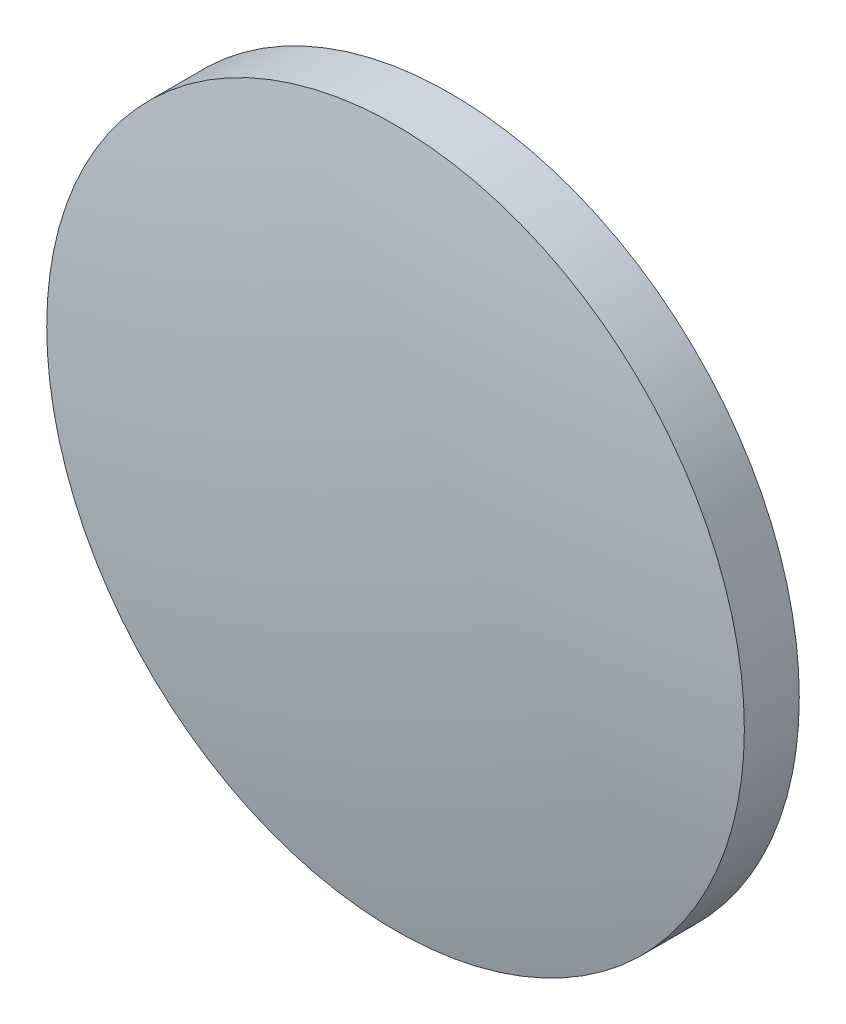
ISO-10303-21;
HEADER;
FILE_DESCRIPTION(('STEP AP214'),'2;1');
FILE_NAME('part.step','',(''),(''),'','','');
FILE_SCHEMA(('AUTOMOTIVE_DESIGN { 1 0 10303 214 1 1 1 1 }'));
ENDSEC;
DATA;
#1=APPLICATION_CONTEXT('core data for automotive mechanical design processes');
#2=APPLICATION_PROTOCOL_DEFINITION('international standard','automotive_design',2000,#1);
#3=PRODUCT_CONTEXT('',#1,'mechanical');
#4=PRODUCT('Part','Part','',(#3));
#5=PRODUCT_RELATED_PRODUCT_CATEGORY('part','',(#4));
#6=PRODUCT_DEFINITION_FORMATION('','',#4);
#7=PRODUCT_DEFINITION_CONTEXT('part definition',#1,'design');
#8=PRODUCT_DEFINITION('design','',#6,#7);
#9=PRODUCT_DEFINITION_SHAPE('','',#8);
#10=(LENGTH_UNIT() NAMED_UNIT(*) SI_UNIT(.MILLI.,.METRE.));
#11=(NAMED_UNIT(*) PLANE_ANGLE_UNIT() SI_UNIT($,.RADIAN.));
#12=(NAMED_UNIT(*) SI_UNIT($,.STERADIAN.) SOLID_ANGLE_UNIT());
#13=UNCERTAINTY_MEASURE_WITH_UNIT(LENGTH_MEASURE(1.E-05),#10,'distance_accuracy_value','');
#14=(GEOMETRIC_REPRESENTATION_CONTEXT(3) GLOBAL_UNCERTAINTY_ASSIGNED_CONTEXT((#13)) GLOBAL_UNIT_ASSIGNED_CONTEXT((#10,
#11,#12)) REPRESENTATION_CONTEXT('',''));
#15=CARTESIAN_POINT('',(0.,0.,0.));
#16=DIRECTION('',(0.,0.,1.));
#17=DIRECTION('',(1.,0.,0.));
#18=AXIS2_PLACEMENT_3D('',#15,#16,#17);
#19=CARTESIAN_POINT('',(-0.00713382400821354,0.,-67.4199996312748));
#20=DIRECTION('',(0.,-1.,0.));
#21=DIRECTION('',(1.,0.,0.));
#22=AXIS2_PLACEMENT_3D('',#19,#20,#21);
#23=CIRCLE('',#22,69.01);
#24=TRIMMED_CURVE('',#23,(PARAMETER_VALUE(-1.57069295302268)),
(PARAMETER_VALUE(1.57069295302268)),.T.,.PARAMETER.);
#25=CARTESIAN_POINT('',(0.,0.,-67.4199996312748));
#26=DIRECTION('',(0.,0.,1.));
#27=AXIS1_PLACEMENT('',#25,#26);
#28=SURFACE_OF_REVOLUTION('',#24,#27);
#29=CARTESIAN_POINT('',(0.,0.,1.59));
#30=VERTEX_POINT('',#29);
#31=VERTEX_LOOP('',#30);
#32=FACE_BOUND('',#31,.T.);
#33=CARTESIAN_POINT('',(0.,0.,0.410000000000001));
#34=DIRECTION('',(0.,0.,1.));
#35=DIRECTION('',(1.,0.,0.));
#36=AXIS2_PLACEMENT_3D('',#33,#34,#35);
#37=CIRCLE('',#36,12.7);
#38=CARTESIAN_POINT('',(12.7,0.,0.410000000000001));
#39=VERTEX_POINT('',#38);
#40=EDGE_CURVE('E21',#39,#39,#37,.T.);
#41=ORIENTED_EDGE('',*,*,#40,.T.);
#42=EDGE_LOOP('',(#41));
#43=FACE_BOUND('',#42,.T.);
#44=ADVANCED_FACE('F15',(#32,#43),#28,.T.);
#45=CARTESIAN_POINT('',(0.,0.,-1.59));
#46=DIRECTION('',(0.,0.,1.));
#47=DIRECTION('',(1.,0.,0.));
#48=AXIS2_PLACEMENT_3D('',#45,#46,#47);
#49=PLANE('',#48);
#50=CARTESIAN_POINT('',(0.,0.,-1.59));
#51=DIRECTION('',(0.,0.,1.));
#52=DIRECTION('',(1.,0.,0.));
#53=AXIS2_PLACEMENT_3D('',#50,#51,#52);
#54=CIRCLE('',#53,12.7);
#55=CARTESIAN_POINT('',(12.7,0.,-1.59));
#56=VERTEX_POINT('',#55);
#57=EDGE_CURVE('E10',#56,#56,#54,.T.);
#58=ORIENTED_EDGE('',*,*,#57,.F.);
#59=EDGE_LOOP('',(#58));
#60=FACE_BOUND('',#59,.T.);
#61=ADVANCED_FACE('F26',(#60),#49,.F.);
#62=CARTESIAN_POINT('',(0.,0.,35.7225457687));
#63=DIRECTION('',(0.,0.,1.));
#64=DIRECTION('',(1.,0.,0.));
#65=AXIS2_PLACEMENT_3D('',#62,#63,#64);
#66=CYLINDRICAL_SURFACE('',#65,12.7);
#67=ORIENTED_EDGE('',*,*,#40,.F.);
#68=EDGE_LOOP('',(#67));
#69=FACE_BOUND('',#68,.T.);
#70=ORIENTED_EDGE('',*,*,#57,.T.);
#71=EDGE_LOOP('',(#70));
#72=FACE_BOUND('',#71,.T.);
#73=ADVANCED_FACE('F30',(#69,#72),#66,.T.);
#74=CLOSED_SHELL('',(#44,#61,#73));
#75=MANIFOLD_SOLID_BREP('B1',#74);
#76=ADVANCED_BREP_SHAPE_REPRESENTATION('',(#18,#75),#14);
#77=SHAPE_DEFINITION_REPRESENTATION(#9,#76);
ENDSEC;
END-ISO-10303-21;
